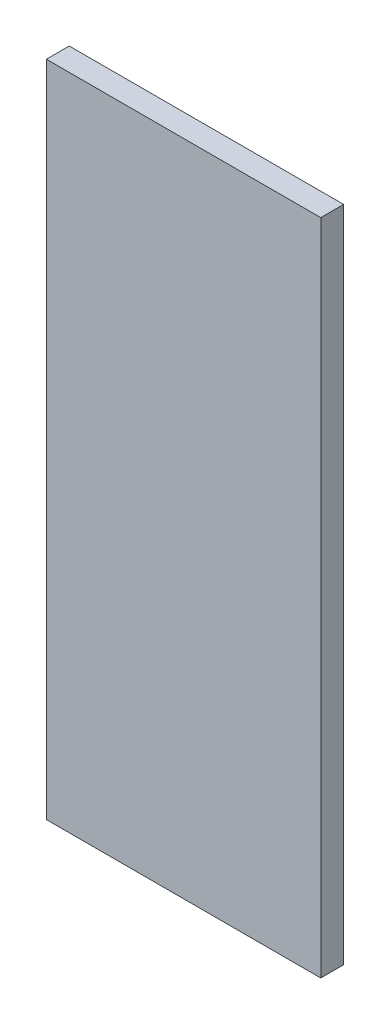
ISO-10303-21;
HEADER;
FILE_DESCRIPTION(('STEP AP214'),'2;1');
FILE_NAME('part.step','',(''),(''),'','','');
FILE_SCHEMA(('AUTOMOTIVE_DESIGN { 1 0 10303 214 1 1 1 1 }'));
ENDSEC;
DATA;
#1=APPLICATION_CONTEXT('core data for automotive mechanical design processes');
#2=APPLICATION_PROTOCOL_DEFINITION('international standard','automotive_design',2000,#1);
#3=PRODUCT_CONTEXT('',#1,'mechanical');
#4=PRODUCT('Part','Part','',(#3));
#5=PRODUCT_RELATED_PRODUCT_CATEGORY('part','',(#4));
#6=PRODUCT_DEFINITION_FORMATION('','',#4);
#7=PRODUCT_DEFINITION_CONTEXT('part definition',#1,'design');
#8=PRODUCT_DEFINITION('design','',#6,#7);
#9=PRODUCT_DEFINITION_SHAPE('','',#8);
#10=(LENGTH_UNIT() NAMED_UNIT(*) SI_UNIT(.MILLI.,.METRE.));
#11=(NAMED_UNIT(*) PLANE_ANGLE_UNIT() SI_UNIT($,.RADIAN.));
#12=(NAMED_UNIT(*) SI_UNIT($,.STERADIAN.) SOLID_ANGLE_UNIT());
#13=UNCERTAINTY_MEASURE_WITH_UNIT(LENGTH_MEASURE(1.E-05),#10,'distance_accuracy_value','');
#14=(GEOMETRIC_REPRESENTATION_CONTEXT(3) GLOBAL_UNCERTAINTY_ASSIGNED_CONTEXT((#13)) GLOBAL_UNIT_ASSIGNED_CONTEXT((#10,
#11,#12)) REPRESENTATION_CONTEXT('',''));
#15=CARTESIAN_POINT('',(0.,0.,0.));
#16=DIRECTION('',(0.,0.,1.));
#17=DIRECTION('',(1.,0.,0.));
#18=AXIS2_PLACEMENT_3D('',#15,#16,#17);
#19=CARTESIAN_POINT('',(-39.2633587786259,91.44,23.0345038167939));
#20=DIRECTION('',(-1.,0.,0.));
#21=DIRECTION('',(0.,0.,1.));
#22=AXIS2_PLACEMENT_3D('',#19,#20,#21);
#23=PLANE('',#22);
#24=DIRECTION('',(0.,0.,-1.));
#25=VECTOR('',#24,1.);
#26=CARTESIAN_POINT('',(-39.2633587786259,0.,23.0345038167939));
#27=LINE('',#26,#25);
#28=CARTESIAN_POINT('',(-39.2633587786259,0.,23.0345038167939));
#29=VERTEX_POINT('',#28);
#30=CARTESIAN_POINT('',(-39.2633587786259,0.,19.8595038167939));
#31=VERTEX_POINT('',#30);
#32=EDGE_CURVE('E107',#29,#31,#27,.T.);
#33=ORIENTED_EDGE('',*,*,#32,.T.);
#34=DIRECTION('',(0.,-1.,0.));
#35=VECTOR('',#34,1.);
#36=CARTESIAN_POINT('',(-39.2633587786259,91.44,19.8595038167939));
#37=LINE('',#36,#35);
#38=CARTESIAN_POINT('',(-39.2633587786259,91.44,19.8595038167939));
#39=VERTEX_POINT('',#38);
#40=EDGE_CURVE('E11',#39,#31,#37,.T.);
#41=ORIENTED_EDGE('',*,*,#40,.F.);
#42=DIRECTION('',(0.,0.,-1.));
#43=VECTOR('',#42,1.);
#44=CARTESIAN_POINT('',(-39.2633587786259,91.44,23.0345038167939));
#45=LINE('',#44,#43);
#46=CARTESIAN_POINT('',(-39.2633587786259,91.44,23.0345038167939));
#47=VERTEX_POINT('',#46);
#48=EDGE_CURVE('E91',#47,#39,#45,.T.);
#49=ORIENTED_EDGE('',*,*,#48,.F.);
#50=DIRECTION('',(0.,-1.,0.));
#51=VECTOR('',#50,1.);
#52=CARTESIAN_POINT('',(-39.2633587786259,91.44,23.0345038167939));
#53=LINE('',#52,#51);
#54=EDGE_CURVE('E103',#47,#29,#53,.T.);
#55=ORIENTED_EDGE('',*,*,#54,.T.);
#56=EDGE_LOOP('',(#33,#41,#49,#55));
#57=FACE_BOUND('',#56,.T.);
#58=ADVANCED_FACE('F39',(#57),#23,.F.);
#59=CARTESIAN_POINT('',(-39.2633587786259,91.44,19.8595038167939));
#60=DIRECTION('',(0.,0.,1.));
#61=DIRECTION('',(1.,0.,0.));
#62=AXIS2_PLACEMENT_3D('',#59,#60,#61);
#63=PLANE('',#62);
#64=DIRECTION('',(-1.,0.,0.));
#65=VECTOR('',#64,1.);
#66=CARTESIAN_POINT('',(-39.2633587786259,0.,19.8595038167939));
#67=LINE('',#66,#65);
#68=CARTESIAN_POINT('',(-77.3633587786259,0.,19.8595038167939));
#69=VERTEX_POINT('',#68);
#70=EDGE_CURVE('E96',#31,#69,#67,.T.);
#71=ORIENTED_EDGE('',*,*,#70,.T.);
#72=DIRECTION('',(0.,-1.,0.));
#73=VECTOR('',#72,1.);
#74=CARTESIAN_POINT('',(-77.3633587786259,91.44,19.8595038167939));
#75=LINE('',#74,#73);
#76=CARTESIAN_POINT('',(-77.3633587786259,91.44,19.8595038167939));
#77=VERTEX_POINT('',#76);
#78=EDGE_CURVE('E48',#77,#69,#75,.T.);
#79=ORIENTED_EDGE('',*,*,#78,.F.);
#80=DIRECTION('',(-1.,0.,0.));
#81=VECTOR('',#80,1.);
#82=CARTESIAN_POINT('',(-39.2633587786259,91.44,19.8595038167939));
#83=LINE('',#82,#81);
#84=EDGE_CURVE('E86',#39,#77,#83,.T.);
#85=ORIENTED_EDGE('',*,*,#84,.F.);
#86=ORIENTED_EDGE('',*,*,#40,.T.);
#87=EDGE_LOOP('',(#71,#79,#85,#86));
#88=FACE_BOUND('',#87,.T.);
#89=ADVANCED_FACE('F95',(#88),#63,.F.);
#90=CARTESIAN_POINT('',(-77.3633587786259,91.44,23.0345038167939));
#91=DIRECTION('',(1.,0.,0.));
#92=DIRECTION('',(0.,0.,-1.));
#93=AXIS2_PLACEMENT_3D('',#90,#91,#92);
#94=PLANE('',#93);
#95=DIRECTION('',(0.,0.,1.));
#96=VECTOR('',#95,1.);
#97=CARTESIAN_POINT('',(-77.3633587786259,0.,23.0345038167939));
#98=LINE('',#97,#96);
#99=CARTESIAN_POINT('',(-77.3633587786259,0.,23.0345038167939));
#100=VERTEX_POINT('',#99);
#101=EDGE_CURVE('E73',#69,#100,#98,.T.);
#102=ORIENTED_EDGE('',*,*,#101,.T.);
#103=DIRECTION('',(0.,-1.,0.));
#104=VECTOR('',#103,1.);
#105=CARTESIAN_POINT('',(-77.3633587786259,91.44,23.0345038167939));
#106=LINE('',#105,#104);
#107=CARTESIAN_POINT('',(-77.3633587786259,91.44,23.0345038167939));
#108=VERTEX_POINT('',#107);
#109=EDGE_CURVE('E98',#108,#100,#106,.T.);
#110=ORIENTED_EDGE('',*,*,#109,.F.);
#111=DIRECTION('',(0.,0.,1.));
#112=VECTOR('',#111,1.);
#113=CARTESIAN_POINT('',(-77.3633587786259,91.44,23.0345038167939));
#114=LINE('',#113,#112);
#115=EDGE_CURVE('E89',#77,#108,#114,.T.);
#116=ORIENTED_EDGE('',*,*,#115,.F.);
#117=ORIENTED_EDGE('',*,*,#78,.T.);
#118=EDGE_LOOP('',(#102,#110,#116,#117));
#119=FACE_BOUND('',#118,.T.);
#120=ADVANCED_FACE('F99',(#119),#94,.F.);
#121=CARTESIAN_POINT('',(-39.2633587786259,91.44,23.0345038167939));
#122=DIRECTION('',(0.,0.,-1.));
#123=DIRECTION('',(-1.,0.,0.));
#124=AXIS2_PLACEMENT_3D('',#121,#122,#123);
#125=PLANE('',#124);
#126=DIRECTION('',(1.,0.,0.));
#127=VECTOR('',#126,1.);
#128=CARTESIAN_POINT('',(-39.2633587786259,0.,23.0345038167939));
#129=LINE('',#128,#127);
#130=EDGE_CURVE('E79',#100,#29,#129,.T.);
#131=ORIENTED_EDGE('',*,*,#130,.T.);
#132=ORIENTED_EDGE('',*,*,#54,.F.);
#133=DIRECTION('',(1.,0.,0.));
#134=VECTOR('',#133,1.);
#135=CARTESIAN_POINT('',(-39.2633587786259,91.44,23.0345038167939));
#136=LINE('',#135,#134);
#137=EDGE_CURVE('E56',#108,#47,#136,.T.);
#138=ORIENTED_EDGE('',*,*,#137,.F.);
#139=ORIENTED_EDGE('',*,*,#109,.T.);
#140=EDGE_LOOP('',(#131,#132,#138,#139));
#141=FACE_BOUND('',#140,.T.);
#142=ADVANCED_FACE('F120',(#141),#125,.F.);
#143=CARTESIAN_POINT('',(0.,91.44,0.));
#144=DIRECTION('',(0.,1.,0.));
#145=DIRECTION('',(0.,0.,1.));
#146=AXIS2_PLACEMENT_3D('',#143,#144,#145);
#147=PLANE('',#146);
#148=ORIENTED_EDGE('',*,*,#48,.T.);
#149=ORIENTED_EDGE('',*,*,#84,.T.);
#150=ORIENTED_EDGE('',*,*,#115,.T.);
#151=ORIENTED_EDGE('',*,*,#137,.T.);
#152=EDGE_LOOP('',(#148,#149,#150,#151));
#153=FACE_BOUND('',#152,.T.);
#154=ADVANCED_FACE('F87',(#153),#147,.T.);
#155=CARTESIAN_POINT('',(0.,0.,0.));
#156=DIRECTION('',(0.,1.,0.));
#157=DIRECTION('',(0.,0.,1.));
#158=AXIS2_PLACEMENT_3D('',#155,#156,#157);
#159=PLANE('',#158);
#160=ORIENTED_EDGE('',*,*,#32,.F.);
#161=ORIENTED_EDGE('',*,*,#130,.F.);
#162=ORIENTED_EDGE('',*,*,#101,.F.);
#163=ORIENTED_EDGE('',*,*,#70,.F.);
#164=EDGE_LOOP('',(#160,#161,#162,#163));
#165=FACE_BOUND('',#164,.T.);
#166=ADVANCED_FACE('F123',(#165),#159,.F.);
#167=CLOSED_SHELL('',(#58,#89,#120,#142,#154,#166));
#168=MANIFOLD_SOLID_BREP('B2',#167);
#169=ADVANCED_BREP_SHAPE_REPRESENTATION('',(#18,#168),#14);
#170=SHAPE_DEFINITION_REPRESENTATION(#9,#169);
ENDSEC;
END-ISO-10303-21;
